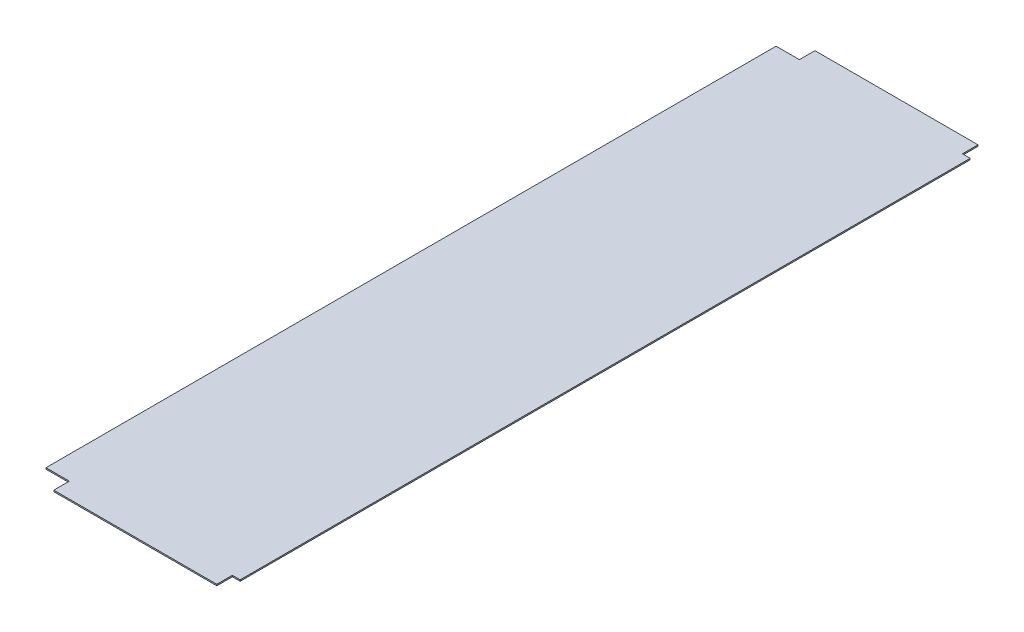
ISO-10303-21;
HEADER;
FILE_DESCRIPTION(('STEP AP214'),'2;1');
FILE_NAME('part.step','',(''),(''),'','','');
FILE_SCHEMA(('AUTOMOTIVE_DESIGN { 1 0 10303 214 1 1 1 1 }'));
ENDSEC;
DATA;
#1=APPLICATION_CONTEXT('core data for automotive mechanical design processes');
#2=APPLICATION_PROTOCOL_DEFINITION('international standard','automotive_design',2000,#1);
#3=PRODUCT_CONTEXT('',#1,'mechanical');
#4=PRODUCT('Part','Part','',(#3));
#5=PRODUCT_RELATED_PRODUCT_CATEGORY('part','',(#4));
#6=PRODUCT_DEFINITION_FORMATION('','',#4);
#7=PRODUCT_DEFINITION_CONTEXT('part definition',#1,'design');
#8=PRODUCT_DEFINITION('design','',#6,#7);
#9=PRODUCT_DEFINITION_SHAPE('','',#8);
#10=(LENGTH_UNIT() NAMED_UNIT(*) SI_UNIT(.MILLI.,.METRE.));
#11=(NAMED_UNIT(*) PLANE_ANGLE_UNIT() SI_UNIT($,.RADIAN.));
#12=(NAMED_UNIT(*) SI_UNIT($,.STERADIAN.) SOLID_ANGLE_UNIT());
#13=UNCERTAINTY_MEASURE_WITH_UNIT(LENGTH_MEASURE(1.E-05),#10,'distance_accuracy_value','');
#14=(GEOMETRIC_REPRESENTATION_CONTEXT(3) GLOBAL_UNCERTAINTY_ASSIGNED_CONTEXT((#13)) GLOBAL_UNIT_ASSIGNED_CONTEXT((#10,
#11,#12)) REPRESENTATION_CONTEXT('',''));
#15=CARTESIAN_POINT('',(0.,0.,0.));
#16=DIRECTION('',(0.,0.,1.));
#17=DIRECTION('',(1.,0.,0.));
#18=AXIS2_PLACEMENT_3D('',#15,#16,#17);
#19=CARTESIAN_POINT('',(-110.,-1.7366,-519.));
#20=DIRECTION('',(0.,0.,-1.));
#21=DIRECTION('',(-1.,0.,0.));
#22=AXIS2_PLACEMENT_3D('',#19,#20,#21);
#23=PLANE('',#22);
#24=DIRECTION('',(-1.,0.,0.));
#25=VECTOR('',#24,1.);
#26=CARTESIAN_POINT('',(-110.,0.,-519.));
#27=LINE('',#26,#25);
#28=CARTESIAN_POINT('',(99.7,0.,-519.));
#29=VERTEX_POINT('',#28);
#30=CARTESIAN_POINT('',(-110.,0.,-519.));
#31=VERTEX_POINT('',#30);
#32=EDGE_CURVE('E160',#29,#31,#27,.T.);
#33=ORIENTED_EDGE('',*,*,#32,.F.);
#34=DIRECTION('',(0.,1.,0.));
#35=VECTOR('',#34,1.);
#36=CARTESIAN_POINT('',(99.7,-1.7366,-519.));
#37=LINE('',#36,#35);
#38=CARTESIAN_POINT('',(99.7,-1.7366,-519.));
#39=VERTEX_POINT('',#38);
#40=EDGE_CURVE('E11',#39,#29,#37,.T.);
#41=ORIENTED_EDGE('',*,*,#40,.F.);
#42=DIRECTION('',(-1.,0.,0.));
#43=VECTOR('',#42,1.);
#44=CARTESIAN_POINT('',(-110.,-1.7366,-519.));
#45=LINE('',#44,#43);
#46=CARTESIAN_POINT('',(-110.,-1.7366,-519.));
#47=VERTEX_POINT('',#46);
#48=EDGE_CURVE('E192',#39,#47,#45,.T.);
#49=ORIENTED_EDGE('',*,*,#48,.T.);
#50=DIRECTION('',(0.,1.,0.));
#51=VECTOR('',#50,1.);
#52=CARTESIAN_POINT('',(-110.,-1.7366,-519.));
#53=LINE('',#52,#51);
#54=EDGE_CURVE('E42',#47,#31,#53,.T.);
#55=ORIENTED_EDGE('',*,*,#54,.T.);
#56=EDGE_LOOP('',(#33,#41,#49,#55));
#57=FACE_BOUND('',#56,.T.);
#58=ADVANCED_FACE('F39',(#57),#23,.T.);
#59=CARTESIAN_POINT('',(99.7,-1.7366,-519.));
#60=DIRECTION('',(1.,0.,0.));
#61=DIRECTION('',(0.,0.,-1.));
#62=AXIS2_PLACEMENT_3D('',#59,#60,#61);
#63=PLANE('',#62);
#64=DIRECTION('',(0.,0.,-1.));
#65=VECTOR('',#64,1.);
#66=CARTESIAN_POINT('',(99.7,0.,-519.));
#67=LINE('',#66,#65);
#68=CARTESIAN_POINT('',(99.6999999999999,0.,-499.));
#69=VERTEX_POINT('',#68);
#70=EDGE_CURVE('E190',#69,#29,#67,.T.);
#71=ORIENTED_EDGE('',*,*,#70,.F.);
#72=DIRECTION('',(0.,1.,0.));
#73=VECTOR('',#72,1.);
#74=CARTESIAN_POINT('',(99.6999999999999,-1.7366,-499.));
#75=LINE('',#74,#73);
#76=CARTESIAN_POINT('',(99.6999999999999,-1.7366,-499.));
#77=VERTEX_POINT('',#76);
#78=EDGE_CURVE('E48',#77,#69,#75,.T.);
#79=ORIENTED_EDGE('',*,*,#78,.F.);
#80=DIRECTION('',(0.,0.,-1.));
#81=VECTOR('',#80,1.);
#82=CARTESIAN_POINT('',(99.7,-1.7366,-519.));
#83=LINE('',#82,#81);
#84=EDGE_CURVE('E150',#77,#39,#83,.T.);
#85=ORIENTED_EDGE('',*,*,#84,.T.);
#86=ORIENTED_EDGE('',*,*,#40,.T.);
#87=EDGE_LOOP('',(#71,#79,#85,#86));
#88=FACE_BOUND('',#87,.T.);
#89=ADVANCED_FACE('F212',(#88),#63,.T.);
#90=CARTESIAN_POINT('',(99.6999999999999,-1.7366,-499.));
#91=DIRECTION('',(0.,0.,-1.));
#92=DIRECTION('',(-1.,0.,0.));
#93=AXIS2_PLACEMENT_3D('',#90,#91,#92);
#94=PLANE('',#93);
#95=DIRECTION('',(-1.,0.,0.));
#96=VECTOR('',#95,1.);
#97=CARTESIAN_POINT('',(99.6999999999999,0.,-499.));
#98=LINE('',#97,#96);
#99=CARTESIAN_POINT('',(109.7,0.,-499.));
#100=VERTEX_POINT('',#99);
#101=EDGE_CURVE('E137',#100,#69,#98,.T.);
#102=ORIENTED_EDGE('',*,*,#101,.F.);
#103=DIRECTION('',(0.,1.,0.));
#104=VECTOR('',#103,1.);
#105=CARTESIAN_POINT('',(109.7,-1.7366,-499.));
#106=LINE('',#105,#104);
#107=CARTESIAN_POINT('',(109.7,-1.7366,-499.));
#108=VERTEX_POINT('',#107);
#109=EDGE_CURVE('E132',#108,#100,#106,.T.);
#110=ORIENTED_EDGE('',*,*,#109,.F.);
#111=DIRECTION('',(-1.,0.,0.));
#112=VECTOR('',#111,1.);
#113=CARTESIAN_POINT('',(99.6999999999999,-1.7366,-499.));
#114=LINE('',#113,#112);
#115=EDGE_CURVE('E135',#108,#77,#114,.T.);
#116=ORIENTED_EDGE('',*,*,#115,.T.);
#117=ORIENTED_EDGE('',*,*,#78,.T.);
#118=EDGE_LOOP('',(#102,#110,#116,#117));
#119=FACE_BOUND('',#118,.T.);
#120=ADVANCED_FACE('F134',(#119),#94,.T.);
#121=CARTESIAN_POINT('',(109.7,-1.7366,440.));
#122=DIRECTION('',(1.,0.,0.));
#123=DIRECTION('',(0.,0.,-1.));
#124=AXIS2_PLACEMENT_3D('',#121,#122,#123);
#125=PLANE('',#124);
#126=DIRECTION('',(0.,0.,-1.));
#127=VECTOR('',#126,1.);
#128=CARTESIAN_POINT('',(109.7,0.,440.));
#129=LINE('',#128,#127);
#130=CARTESIAN_POINT('',(109.7,0.,440.));
#131=VERTEX_POINT('',#130);
#132=EDGE_CURVE('E187',#131,#100,#129,.T.);
#133=ORIENTED_EDGE('',*,*,#132,.F.);
#134=DIRECTION('',(0.,1.,0.));
#135=VECTOR('',#134,1.);
#136=CARTESIAN_POINT('',(109.7,-1.7366,440.));
#137=LINE('',#136,#135);
#138=CARTESIAN_POINT('',(109.7,-1.7366,440.));
#139=VERTEX_POINT('',#138);
#140=EDGE_CURVE('E142',#139,#131,#137,.T.);
#141=ORIENTED_EDGE('',*,*,#140,.F.);
#142=DIRECTION('',(0.,0.,-1.));
#143=VECTOR('',#142,1.);
#144=CARTESIAN_POINT('',(109.7,-1.7366,440.));
#145=LINE('',#144,#143);
#146=EDGE_CURVE('E148',#139,#108,#145,.T.);
#147=ORIENTED_EDGE('',*,*,#146,.T.);
#148=ORIENTED_EDGE('',*,*,#109,.T.);
#149=EDGE_LOOP('',(#133,#141,#147,#148));
#150=FACE_BOUND('',#149,.T.);
#151=ADVANCED_FACE('F152',(#150),#125,.T.);
#152=CARTESIAN_POINT('',(109.7,-1.7366,440.));
#153=DIRECTION('',(0.,0.,1.));
#154=DIRECTION('',(1.,0.,0.));
#155=AXIS2_PLACEMENT_3D('',#152,#153,#154);
#156=PLANE('',#155);
#157=DIRECTION('',(1.,0.,0.));
#158=VECTOR('',#157,1.);
#159=CARTESIAN_POINT('',(109.7,0.,440.));
#160=LINE('',#159,#158);
#161=CARTESIAN_POINT('',(99.7000000000002,0.,440.));
#162=VERTEX_POINT('',#161);
#163=EDGE_CURVE('E184',#162,#131,#160,.T.);
#164=ORIENTED_EDGE('',*,*,#163,.F.);
#165=DIRECTION('',(0.,1.,0.));
#166=VECTOR('',#165,1.);
#167=CARTESIAN_POINT('',(99.7000000000002,-1.7366,440.));
#168=LINE('',#167,#166);
#169=CARTESIAN_POINT('',(99.7000000000002,-1.7366,440.));
#170=VERTEX_POINT('',#169);
#171=EDGE_CURVE('E196',#170,#162,#168,.T.);
#172=ORIENTED_EDGE('',*,*,#171,.F.);
#173=DIRECTION('',(1.,0.,0.));
#174=VECTOR('',#173,1.);
#175=CARTESIAN_POINT('',(109.7,-1.7366,440.));
#176=LINE('',#175,#174);
#177=EDGE_CURVE('E153',#170,#139,#176,.T.);
#178=ORIENTED_EDGE('',*,*,#177,.T.);
#179=ORIENTED_EDGE('',*,*,#140,.T.);
#180=EDGE_LOOP('',(#164,#172,#178,#179));
#181=FACE_BOUND('',#180,.T.);
#182=ADVANCED_FACE('F225',(#181),#156,.T.);
#183=CARTESIAN_POINT('',(99.7000000000002,-1.7366,440.));
#184=DIRECTION('',(1.,0.,0.));
#185=DIRECTION('',(0.,0.,-1.));
#186=AXIS2_PLACEMENT_3D('',#183,#184,#185);
#187=PLANE('',#186);
#188=DIRECTION('',(0.,0.,-1.));
#189=VECTOR('',#188,1.);
#190=CARTESIAN_POINT('',(99.7000000000002,0.,440.));
#191=LINE('',#190,#189);
#192=CARTESIAN_POINT('',(99.7000000000002,0.,460.));
#193=VERTEX_POINT('',#192);
#194=EDGE_CURVE('E181',#193,#162,#191,.T.);
#195=ORIENTED_EDGE('',*,*,#194,.F.);
#196=DIRECTION('',(0.,1.,0.));
#197=VECTOR('',#196,1.);
#198=CARTESIAN_POINT('',(99.7000000000002,-1.7366,460.));
#199=LINE('',#198,#197);
#200=CARTESIAN_POINT('',(99.7000000000002,-1.7366,460.));
#201=VERTEX_POINT('',#200);
#202=EDGE_CURVE('E198',#201,#193,#199,.T.);
#203=ORIENTED_EDGE('',*,*,#202,.F.);
#204=DIRECTION('',(0.,0.,-1.));
#205=VECTOR('',#204,1.);
#206=CARTESIAN_POINT('',(99.7000000000002,-1.7366,440.));
#207=LINE('',#206,#205);
#208=EDGE_CURVE('E155',#201,#170,#207,.T.);
#209=ORIENTED_EDGE('',*,*,#208,.T.);
#210=ORIENTED_EDGE('',*,*,#171,.T.);
#211=EDGE_LOOP('',(#195,#203,#209,#210));
#212=FACE_BOUND('',#211,.T.);
#213=ADVANCED_FACE('F228',(#212),#187,.T.);
#214=CARTESIAN_POINT('',(-110.,-1.7366,460.));
#215=DIRECTION('',(0.,0.,1.));
#216=DIRECTION('',(1.,0.,0.));
#217=AXIS2_PLACEMENT_3D('',#214,#215,#216);
#218=PLANE('',#217);
#219=DIRECTION('',(1.,0.,0.));
#220=VECTOR('',#219,1.);
#221=CARTESIAN_POINT('',(-110.,0.,460.));
#222=LINE('',#221,#220);
#223=CARTESIAN_POINT('',(-110.,0.,460.));
#224=VERTEX_POINT('',#223);
#225=EDGE_CURVE('E178',#224,#193,#222,.T.);
#226=ORIENTED_EDGE('',*,*,#225,.F.);
#227=DIRECTION('',(0.,1.,0.));
#228=VECTOR('',#227,1.);
#229=CARTESIAN_POINT('',(-110.,-1.7366,460.));
#230=LINE('',#229,#228);
#231=CARTESIAN_POINT('',(-110.,-1.7366,460.));
#232=VERTEX_POINT('',#231);
#233=EDGE_CURVE('E200',#232,#224,#230,.T.);
#234=ORIENTED_EDGE('',*,*,#233,.F.);
#235=DIRECTION('',(1.,0.,0.));
#236=VECTOR('',#235,1.);
#237=CARTESIAN_POINT('',(-110.,-1.7366,460.));
#238=LINE('',#237,#236);
#239=EDGE_CURVE('E382',#232,#201,#238,.T.);
#240=ORIENTED_EDGE('',*,*,#239,.T.);
#241=ORIENTED_EDGE('',*,*,#202,.T.);
#242=EDGE_LOOP('',(#226,#234,#240,#241));
#243=FACE_BOUND('',#242,.T.);
#244=ADVANCED_FACE('F232',(#243),#218,.T.);
#245=CARTESIAN_POINT('',(-110.,-1.7366,440.));
#246=DIRECTION('',(-1.,0.,0.));
#247=DIRECTION('',(0.,0.,1.));
#248=AXIS2_PLACEMENT_3D('',#245,#246,#247);
#249=PLANE('',#248);
#250=DIRECTION('',(0.,0.,1.));
#251=VECTOR('',#250,1.);
#252=CARTESIAN_POINT('',(-110.,0.,440.));
#253=LINE('',#252,#251);
#254=CARTESIAN_POINT('',(-110.,0.,440.));
#255=VERTEX_POINT('',#254);
#256=EDGE_CURVE('E175',#255,#224,#253,.T.);
#257=ORIENTED_EDGE('',*,*,#256,.F.);
#258=DIRECTION('',(0.,1.,0.));
#259=VECTOR('',#258,1.);
#260=CARTESIAN_POINT('',(-110.,-1.7366,440.));
#261=LINE('',#260,#259);
#262=CARTESIAN_POINT('',(-110.,-1.7366,440.));
#263=VERTEX_POINT('',#262);
#264=EDGE_CURVE('E202',#263,#255,#261,.T.);
#265=ORIENTED_EDGE('',*,*,#264,.F.);
#266=DIRECTION('',(0.,0.,1.));
#267=VECTOR('',#266,1.);
#268=CARTESIAN_POINT('',(-110.,-1.7366,440.));
#269=LINE('',#268,#267);
#270=EDGE_CURVE('E386',#263,#232,#269,.T.);
#271=ORIENTED_EDGE('',*,*,#270,.T.);
#272=ORIENTED_EDGE('',*,*,#233,.T.);
#273=EDGE_LOOP('',(#257,#265,#271,#272));
#274=FACE_BOUND('',#273,.T.);
#275=ADVANCED_FACE('F236',(#274),#249,.T.);
#276=CARTESIAN_POINT('',(-140.,-1.7366,440.));
#277=DIRECTION('',(0.,0.,1.));
#278=DIRECTION('',(1.,0.,0.));
#279=AXIS2_PLACEMENT_3D('',#276,#277,#278);
#280=PLANE('',#279);
#281=DIRECTION('',(1.,0.,0.));
#282=VECTOR('',#281,1.);
#283=CARTESIAN_POINT('',(-140.,0.,440.));
#284=LINE('',#283,#282);
#285=CARTESIAN_POINT('',(-140.,0.,440.));
#286=VERTEX_POINT('',#285);
#287=EDGE_CURVE('E172',#286,#255,#284,.T.);
#288=ORIENTED_EDGE('',*,*,#287,.F.);
#289=DIRECTION('',(0.,1.,0.));
#290=VECTOR('',#289,1.);
#291=CARTESIAN_POINT('',(-140.,-1.7366,440.));
#292=LINE('',#291,#290);
#293=CARTESIAN_POINT('',(-140.,-1.7366,440.));
#294=VERTEX_POINT('',#293);
#295=EDGE_CURVE('E204',#294,#286,#292,.T.);
#296=ORIENTED_EDGE('',*,*,#295,.F.);
#297=DIRECTION('',(1.,0.,0.));
#298=VECTOR('',#297,1.);
#299=CARTESIAN_POINT('',(-140.,-1.7366,440.));
#300=LINE('',#299,#298);
#301=EDGE_CURVE('E375',#294,#263,#300,.T.);
#302=ORIENTED_EDGE('',*,*,#301,.T.);
#303=ORIENTED_EDGE('',*,*,#264,.T.);
#304=EDGE_LOOP('',(#288,#296,#302,#303));
#305=FACE_BOUND('',#304,.T.);
#306=ADVANCED_FACE('F240',(#305),#280,.T.);
#307=CARTESIAN_POINT('',(-140.,-1.7366,440.));
#308=DIRECTION('',(-1.,0.,0.));
#309=DIRECTION('',(0.,0.,1.));
#310=AXIS2_PLACEMENT_3D('',#307,#308,#309);
#311=PLANE('',#310);
#312=DIRECTION('',(0.,0.,1.));
#313=VECTOR('',#312,1.);
#314=CARTESIAN_POINT('',(-140.,0.,440.));
#315=LINE('',#314,#313);
#316=CARTESIAN_POINT('',(-140.,0.,-499.));
#317=VERTEX_POINT('',#316);
#318=EDGE_CURVE('E169',#317,#286,#315,.T.);
#319=ORIENTED_EDGE('',*,*,#318,.F.);
#320=DIRECTION('',(0.,1.,0.));
#321=VECTOR('',#320,1.);
#322=CARTESIAN_POINT('',(-140.,-1.7366,-499.));
#323=LINE('',#322,#321);
#324=CARTESIAN_POINT('',(-140.,-1.7366,-499.));
#325=VERTEX_POINT('',#324);
#326=EDGE_CURVE('E206',#325,#317,#323,.T.);
#327=ORIENTED_EDGE('',*,*,#326,.F.);
#328=DIRECTION('',(0.,0.,1.));
#329=VECTOR('',#328,1.);
#330=CARTESIAN_POINT('',(-140.,-1.7366,440.));
#331=LINE('',#330,#329);
#332=EDGE_CURVE('E371',#325,#294,#331,.T.);
#333=ORIENTED_EDGE('',*,*,#332,.T.);
#334=ORIENTED_EDGE('',*,*,#295,.T.);
#335=EDGE_LOOP('',(#319,#327,#333,#334));
#336=FACE_BOUND('',#335,.T.);
#337=ADVANCED_FACE('F244',(#336),#311,.T.);
#338=CARTESIAN_POINT('',(-110.,-1.7366,-499.));
#339=DIRECTION('',(0.,0.,-1.));
#340=DIRECTION('',(-1.,0.,0.));
#341=AXIS2_PLACEMENT_3D('',#338,#339,#340);
#342=PLANE('',#341);
#343=DIRECTION('',(-1.,0.,0.));
#344=VECTOR('',#343,1.);
#345=CARTESIAN_POINT('',(-110.,0.,-499.));
#346=LINE('',#345,#344);
#347=CARTESIAN_POINT('',(-110.,0.,-499.));
#348=VERTEX_POINT('',#347);
#349=EDGE_CURVE('E166',#348,#317,#346,.T.);
#350=ORIENTED_EDGE('',*,*,#349,.F.);
#351=DIRECTION('',(0.,1.,0.));
#352=VECTOR('',#351,1.);
#353=CARTESIAN_POINT('',(-110.,-1.7366,-499.));
#354=LINE('',#353,#352);
#355=CARTESIAN_POINT('',(-110.,-1.7366,-499.));
#356=VERTEX_POINT('',#355);
#357=EDGE_CURVE('E207',#356,#348,#354,.T.);
#358=ORIENTED_EDGE('',*,*,#357,.F.);
#359=DIRECTION('',(-1.,0.,0.));
#360=VECTOR('',#359,1.);
#361=CARTESIAN_POINT('',(-110.,-1.7366,-499.));
#362=LINE('',#361,#360);
#363=EDGE_CURVE('E392',#356,#325,#362,.T.);
#364=ORIENTED_EDGE('',*,*,#363,.T.);
#365=ORIENTED_EDGE('',*,*,#326,.T.);
#366=EDGE_LOOP('',(#350,#358,#364,#365));
#367=FACE_BOUND('',#366,.T.);
#368=ADVANCED_FACE('F248',(#367),#342,.T.);
#369=CARTESIAN_POINT('',(-110.,-1.7366,-519.));
#370=DIRECTION('',(-1.,0.,0.));
#371=DIRECTION('',(0.,0.,1.));
#372=AXIS2_PLACEMENT_3D('',#369,#370,#371);
#373=PLANE('',#372);
#374=DIRECTION('',(0.,0.,1.));
#375=VECTOR('',#374,1.);
#376=CARTESIAN_POINT('',(-110.,0.,-519.));
#377=LINE('',#376,#375);
#378=EDGE_CURVE('E163',#31,#348,#377,.T.);
#379=ORIENTED_EDGE('',*,*,#378,.F.);
#380=ORIENTED_EDGE('',*,*,#54,.F.);
#381=DIRECTION('',(0.,0.,1.));
#382=VECTOR('',#381,1.);
#383=CARTESIAN_POINT('',(-110.,-1.7366,-519.));
#384=LINE('',#383,#382);
#385=EDGE_CURVE('E394',#47,#356,#384,.T.);
#386=ORIENTED_EDGE('',*,*,#385,.T.);
#387=ORIENTED_EDGE('',*,*,#357,.T.);
#388=EDGE_LOOP('',(#379,#380,#386,#387));
#389=FACE_BOUND('',#388,.T.);
#390=ADVANCED_FACE('F209',(#389),#373,.T.);
#391=CARTESIAN_POINT('',(0.,-1.7366,0.));
#392=DIRECTION('',(0.,-1.,0.));
#393=DIRECTION('',(0.,0.,-1.));
#394=AXIS2_PLACEMENT_3D('',#391,#392,#393);
#395=PLANE('',#394);
#396=ORIENTED_EDGE('',*,*,#48,.F.);
#397=ORIENTED_EDGE('',*,*,#84,.F.);
#398=ORIENTED_EDGE('',*,*,#115,.F.);
#399=ORIENTED_EDGE('',*,*,#146,.F.);
#400=ORIENTED_EDGE('',*,*,#177,.F.);
#401=ORIENTED_EDGE('',*,*,#208,.F.);
#402=ORIENTED_EDGE('',*,*,#239,.F.);
#403=ORIENTED_EDGE('',*,*,#270,.F.);
#404=ORIENTED_EDGE('',*,*,#301,.F.);
#405=ORIENTED_EDGE('',*,*,#332,.F.);
#406=ORIENTED_EDGE('',*,*,#363,.F.);
#407=ORIENTED_EDGE('',*,*,#385,.F.);
#408=EDGE_LOOP('',(#396,#397,#398,#399,#400,#401,#402,#403,#404,#405,#406,#407));
#409=FACE_BOUND('',#408,.T.);
#410=ADVANCED_FACE('F146',(#409),#395,.T.);
#411=CARTESIAN_POINT('',(0.,0.,0.));
#412=DIRECTION('',(0.,-1.,0.));
#413=DIRECTION('',(0.,0.,-1.));
#414=AXIS2_PLACEMENT_3D('',#411,#412,#413);
#415=PLANE('',#414);
#416=ORIENTED_EDGE('',*,*,#32,.T.);
#417=ORIENTED_EDGE('',*,*,#378,.T.);
#418=ORIENTED_EDGE('',*,*,#349,.T.);
#419=ORIENTED_EDGE('',*,*,#318,.T.);
#420=ORIENTED_EDGE('',*,*,#287,.T.);
#421=ORIENTED_EDGE('',*,*,#256,.T.);
#422=ORIENTED_EDGE('',*,*,#225,.T.);
#423=ORIENTED_EDGE('',*,*,#194,.T.);
#424=ORIENTED_EDGE('',*,*,#163,.T.);
#425=ORIENTED_EDGE('',*,*,#132,.T.);
#426=ORIENTED_EDGE('',*,*,#101,.T.);
#427=ORIENTED_EDGE('',*,*,#70,.T.);
#428=EDGE_LOOP('',(#416,#417,#418,#419,#420,#421,#422,#423,#424,#425,#426,#427));
#429=FACE_BOUND('',#428,.T.);
#430=ADVANCED_FACE('F211',(#429),#415,.F.);
#431=CLOSED_SHELL('',(#58,#89,#120,#151,#182,#213,#244,#275,#306,#337,#368,#390,#410,#430));
#432=MANIFOLD_SOLID_BREP('B2',#431);
#433=ADVANCED_BREP_SHAPE_REPRESENTATION('',(#18,#432),#14);
#434=SHAPE_DEFINITION_REPRESENTATION(#9,#433);
ENDSEC;
END-ISO-10303-21;
